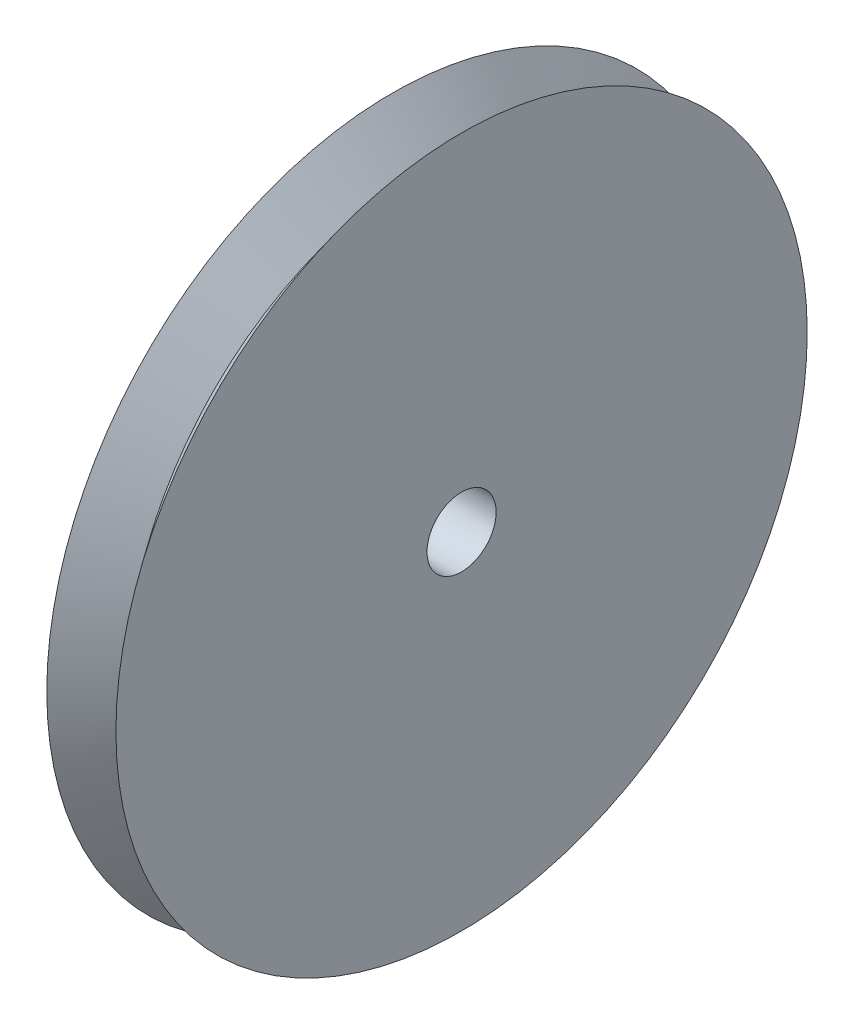
ISO-10303-21;
HEADER;
FILE_DESCRIPTION(('STEP AP214'),'2;1');
FILE_NAME('part.step','',(''),(''),'','','');
FILE_SCHEMA(('AUTOMOTIVE_DESIGN { 1 0 10303 214 1 1 1 1 }'));
ENDSEC;
DATA;
#1=APPLICATION_CONTEXT('core data for automotive mechanical design processes');
#2=APPLICATION_PROTOCOL_DEFINITION('international standard','automotive_design',2000,#1);
#3=PRODUCT_CONTEXT('',#1,'mechanical');
#4=PRODUCT('Part','Part','',(#3));
#5=PRODUCT_RELATED_PRODUCT_CATEGORY('part','',(#4));
#6=PRODUCT_DEFINITION_FORMATION('','',#4);
#7=PRODUCT_DEFINITION_CONTEXT('part definition',#1,'design');
#8=PRODUCT_DEFINITION('design','',#6,#7);
#9=PRODUCT_DEFINITION_SHAPE('','',#8);
#10=(LENGTH_UNIT() NAMED_UNIT(*) SI_UNIT(.MILLI.,.METRE.));
#11=(NAMED_UNIT(*) PLANE_ANGLE_UNIT() SI_UNIT($,.RADIAN.));
#12=(NAMED_UNIT(*) SI_UNIT($,.STERADIAN.) SOLID_ANGLE_UNIT());
#13=UNCERTAINTY_MEASURE_WITH_UNIT(LENGTH_MEASURE(1.E-05),#10,'distance_accuracy_value','');
#14=(GEOMETRIC_REPRESENTATION_CONTEXT(3) GLOBAL_UNCERTAINTY_ASSIGNED_CONTEXT((#13)) GLOBAL_UNIT_ASSIGNED_CONTEXT((#10,
#11,#12)) REPRESENTATION_CONTEXT('',''));
#15=CARTESIAN_POINT('',(0.,0.,0.));
#16=DIRECTION('',(0.,0.,1.));
#17=DIRECTION('',(1.,0.,0.));
#18=AXIS2_PLACEMENT_3D('',#15,#16,#17);
#19=CARTESIAN_POINT('',(2.54,0.,0.));
#20=DIRECTION('',(1.,0.,0.));
#21=DIRECTION('',(0.,0.,-1.));
#22=AXIS2_PLACEMENT_3D('',#19,#20,#21);
#23=CONICAL_SURFACE('',#22,22.098,0.915100700553361);
#24=CARTESIAN_POINT('',(5.08,0.,0.));
#25=DIRECTION('',(-1.,0.,0.));
#26=DIRECTION('',(0.,0.,1.));
#27=AXIS2_PLACEMENT_3D('',#24,#25,#26);
#28=CIRCLE('',#27,25.4);
#29=CARTESIAN_POINT('',(5.08,0.,25.4));
#30=VERTEX_POINT('',#29);
#31=EDGE_CURVE('E41',#30,#30,#28,.T.);
#32=ORIENTED_EDGE('',*,*,#31,.T.);
#33=EDGE_LOOP('',(#32));
#34=FACE_BOUND('',#33,.T.);
#35=CARTESIAN_POINT('',(2.54,0.,0.));
#36=DIRECTION('',(-1.,0.,0.));
#37=DIRECTION('',(0.,0.,1.));
#38=AXIS2_PLACEMENT_3D('',#35,#36,#37);
#39=CIRCLE('',#38,22.098);
#40=CARTESIAN_POINT('',(2.54,0.,22.098));
#41=VERTEX_POINT('',#40);
#42=EDGE_CURVE('E10',#41,#41,#39,.T.);
#43=ORIENTED_EDGE('',*,*,#42,.F.);
#44=EDGE_LOOP('',(#43));
#45=FACE_BOUND('',#44,.T.);
#46=ADVANCED_FACE('F31',(#34,#45),#23,.T.);
#47=CARTESIAN_POINT('',(0.,0.,0.));
#48=DIRECTION('',(-1.,0.,0.));
#49=DIRECTION('',(0.,0.,1.));
#50=AXIS2_PLACEMENT_3D('',#47,#48,#49);
#51=CONICAL_SURFACE('',#50,25.4,0.915100700553361);
#52=ORIENTED_EDGE('',*,*,#42,.T.);
#53=EDGE_LOOP('',(#52));
#54=FACE_BOUND('',#53,.T.);
#55=CARTESIAN_POINT('',(0.,0.,0.));
#56=DIRECTION('',(-1.,0.,0.));
#57=DIRECTION('',(0.,0.,1.));
#58=AXIS2_PLACEMENT_3D('',#55,#56,#57);
#59=CIRCLE('',#58,25.4);
#60=CARTESIAN_POINT('',(0.,0.,25.4));
#61=VERTEX_POINT('',#60);
#62=EDGE_CURVE('E37',#61,#61,#59,.T.);
#63=ORIENTED_EDGE('',*,*,#62,.F.);
#64=EDGE_LOOP('',(#63));
#65=FACE_BOUND('',#64,.T.);
#66=ADVANCED_FACE('F70',(#54,#65),#51,.T.);
#67=CARTESIAN_POINT('',(0.,0.,0.));
#68=DIRECTION('',(-1.,0.,0.));
#69=DIRECTION('',(0.,0.,1.));
#70=AXIS2_PLACEMENT_3D('',#67,#68,#69);
#71=PLANE('',#70);
#72=CARTESIAN_POINT('',(0.,0.,0.));
#73=DIRECTION('',(1.,0.,0.));
#74=DIRECTION('',(0.,0.,-1.));
#75=AXIS2_PLACEMENT_3D('',#72,#73,#74);
#76=CIRCLE('',#75,2.54);
#77=CARTESIAN_POINT('',(0.,0.,-2.54));
#78=VERTEX_POINT('',#77);
#79=EDGE_CURVE('E45',#78,#78,#76,.T.);
#80=ORIENTED_EDGE('',*,*,#79,.T.);
#81=EDGE_LOOP('',(#80));
#82=FACE_BOUND('',#81,.T.);
#83=ORIENTED_EDGE('',*,*,#62,.T.);
#84=EDGE_LOOP('',(#83));
#85=FACE_BOUND('',#84,.T.);
#86=ADVANCED_FACE('F54',(#82,#85),#71,.T.);
#87=CARTESIAN_POINT('',(5.08,0.,0.));
#88=DIRECTION('',(-1.,0.,0.));
#89=DIRECTION('',(0.,0.,1.));
#90=AXIS2_PLACEMENT_3D('',#87,#88,#89);
#91=PLANE('',#90);
#92=CARTESIAN_POINT('',(5.08,0.,0.));
#93=DIRECTION('',(1.,0.,0.));
#94=DIRECTION('',(0.,0.,-1.));
#95=AXIS2_PLACEMENT_3D('',#92,#93,#94);
#96=CIRCLE('',#95,2.54);
#97=CARTESIAN_POINT('',(5.08,0.,-2.54));
#98=VERTEX_POINT('',#97);
#99=EDGE_CURVE('E48',#98,#98,#96,.T.);
#100=ORIENTED_EDGE('',*,*,#99,.F.);
#101=EDGE_LOOP('',(#100));
#102=FACE_BOUND('',#101,.T.);
#103=ORIENTED_EDGE('',*,*,#31,.F.);
#104=EDGE_LOOP('',(#103));
#105=FACE_BOUND('',#104,.T.);
#106=ADVANCED_FACE('F59',(#102,#105),#91,.F.);
#107=CARTESIAN_POINT('',(0.,0.,0.));
#108=DIRECTION('',(1.,0.,0.));
#109=DIRECTION('',(0.,0.,-1.));
#110=AXIS2_PLACEMENT_3D('',#107,#108,#109);
#111=CYLINDRICAL_SURFACE('',#110,2.54);
#112=ORIENTED_EDGE('',*,*,#79,.F.);
#113=EDGE_LOOP('',(#112));
#114=FACE_BOUND('',#113,.T.);
#115=ORIENTED_EDGE('',*,*,#99,.T.);
#116=EDGE_LOOP('',(#115));
#117=FACE_BOUND('',#116,.T.);
#118=ADVANCED_FACE('F56',(#114,#117),#111,.F.);
#119=CLOSED_SHELL('',(#46,#66,#86,#106,#118));
#120=MANIFOLD_SOLID_BREP('B2',#119);
#121=ADVANCED_BREP_SHAPE_REPRESENTATION('',(#18,#120),#14);
#122=SHAPE_DEFINITION_REPRESENTATION(#9,#121);
ENDSEC;
END-ISO-10303-21;
